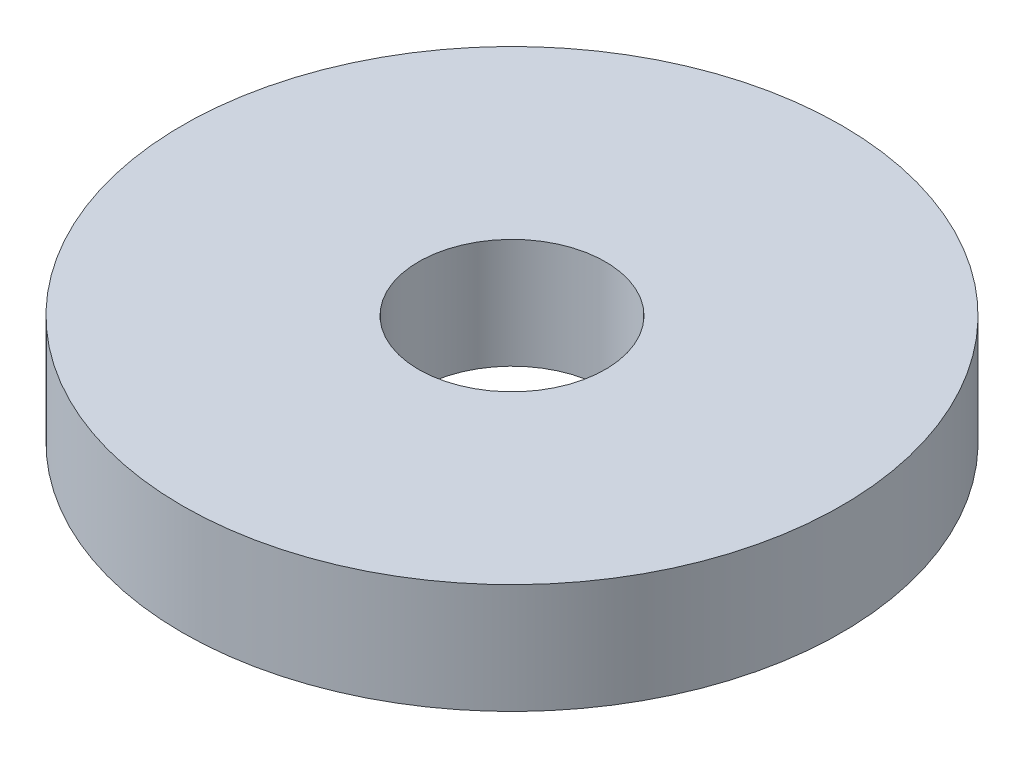
ISO-10303-21;
HEADER;
FILE_DESCRIPTION(('STEP AP214'),'2;1');
FILE_NAME('part.step','',(''),(''),'','','');
FILE_SCHEMA(('AUTOMOTIVE_DESIGN { 1 0 10303 214 1 1 1 1 }'));
ENDSEC;
DATA;
#1=APPLICATION_CONTEXT('core data for automotive mechanical design processes');
#2=APPLICATION_PROTOCOL_DEFINITION('international standard','automotive_design',2000,#1);
#3=PRODUCT_CONTEXT('',#1,'mechanical');
#4=PRODUCT('Part','Part','',(#3));
#5=PRODUCT_RELATED_PRODUCT_CATEGORY('part','',(#4));
#6=PRODUCT_DEFINITION_FORMATION('','',#4);
#7=PRODUCT_DEFINITION_CONTEXT('part definition',#1,'design');
#8=PRODUCT_DEFINITION('design','',#6,#7);
#9=PRODUCT_DEFINITION_SHAPE('','',#8);
#10=(LENGTH_UNIT() NAMED_UNIT(*) SI_UNIT(.MILLI.,.METRE.));
#11=(NAMED_UNIT(*) PLANE_ANGLE_UNIT() SI_UNIT($,.RADIAN.));
#12=(NAMED_UNIT(*) SI_UNIT($,.STERADIAN.) SOLID_ANGLE_UNIT());
#13=UNCERTAINTY_MEASURE_WITH_UNIT(LENGTH_MEASURE(1.E-05),#10,'distance_accuracy_value','');
#14=(GEOMETRIC_REPRESENTATION_CONTEXT(3) GLOBAL_UNCERTAINTY_ASSIGNED_CONTEXT((#13)) GLOBAL_UNIT_ASSIGNED_CONTEXT((#10,
#11,#12)) REPRESENTATION_CONTEXT('',''));
#15=CARTESIAN_POINT('',(0.,0.,0.));
#16=DIRECTION('',(0.,0.,1.));
#17=DIRECTION('',(1.,0.,0.));
#18=AXIS2_PLACEMENT_3D('',#15,#16,#17);
#19=CARTESIAN_POINT('',(0.,-10.,0.));
#20=DIRECTION('',(0.,1.,0.));
#21=DIRECTION('',(0.,0.,0.999999999999997));
#22=AXIS2_PLACEMENT_3D('',#19,#20,#21);
#23=CYLINDRICAL_SURFACE('',#22,30.);
#24=CARTESIAN_POINT('',(0.,-10.,0.));
#25=DIRECTION('',(0.,1.,0.));
#26=DIRECTION('',(0.,0.,0.999999999999997));
#27=AXIS2_PLACEMENT_3D('',#24,#25,#26);
#28=CIRCLE('',#27,30.);
#29=CARTESIAN_POINT('',(0.,-10.,29.9999999999999));
#30=VERTEX_POINT('',#29);
#31=EDGE_CURVE('E10',#30,#30,#28,.T.);
#32=ORIENTED_EDGE('',*,*,#31,.T.);
#33=EDGE_LOOP('',(#32));
#34=FACE_BOUND('',#33,.T.);
#35=CARTESIAN_POINT('',(0.,0.,0.));
#36=DIRECTION('',(0.,1.,0.));
#37=DIRECTION('',(0.,0.,0.999999999999997));
#38=AXIS2_PLACEMENT_3D('',#35,#36,#37);
#39=CIRCLE('',#38,30.);
#40=CARTESIAN_POINT('',(0.,0.,29.9999999999999));
#41=VERTEX_POINT('',#40);
#42=EDGE_CURVE('E39',#41,#41,#39,.T.);
#43=ORIENTED_EDGE('',*,*,#42,.F.);
#44=EDGE_LOOP('',(#43));
#45=FACE_BOUND('',#44,.T.);
#46=ADVANCED_FACE('F36',(#34,#45),#23,.T.);
#47=CARTESIAN_POINT('',(0.,-10.,0.));
#48=DIRECTION('',(0.,1.,0.));
#49=DIRECTION('',(0.,0.,0.999999999999997));
#50=AXIS2_PLACEMENT_3D('',#47,#48,#49);
#51=PLANE('',#50);
#52=CARTESIAN_POINT('',(0.,-10.,0.));
#53=DIRECTION('',(0.,1.,0.));
#54=DIRECTION('',(0.,0.,0.999999999999997));
#55=AXIS2_PLACEMENT_3D('',#52,#53,#54);
#56=CIRCLE('',#55,8.5);
#57=CARTESIAN_POINT('',(0.,-10.,8.49999999999998));
#58=VERTEX_POINT('',#57);
#59=EDGE_CURVE('E46',#58,#58,#56,.T.);
#60=ORIENTED_EDGE('',*,*,#59,.T.);
#61=EDGE_LOOP('',(#60));
#62=FACE_BOUND('',#61,.T.);
#63=ORIENTED_EDGE('',*,*,#31,.F.);
#64=EDGE_LOOP('',(#63));
#65=FACE_BOUND('',#64,.T.);
#66=ADVANCED_FACE('F59',(#62,#65),#51,.F.);
#67=CARTESIAN_POINT('',(0.,0.,0.));
#68=DIRECTION('',(0.,1.,0.));
#69=DIRECTION('',(0.,0.,0.999999999999997));
#70=AXIS2_PLACEMENT_3D('',#67,#68,#69);
#71=PLANE('',#70);
#72=CARTESIAN_POINT('',(0.,0.,0.));
#73=DIRECTION('',(0.,1.,0.));
#74=DIRECTION('',(0.,0.,0.999999999999997));
#75=AXIS2_PLACEMENT_3D('',#72,#73,#74);
#76=CIRCLE('',#75,8.5);
#77=CARTESIAN_POINT('',(0.,0.,8.49999999999998));
#78=VERTEX_POINT('',#77);
#79=EDGE_CURVE('E50',#78,#78,#76,.T.);
#80=ORIENTED_EDGE('',*,*,#79,.F.);
#81=EDGE_LOOP('',(#80));
#82=FACE_BOUND('',#81,.T.);
#83=ORIENTED_EDGE('',*,*,#42,.T.);
#84=EDGE_LOOP('',(#83));
#85=FACE_BOUND('',#84,.T.);
#86=ADVANCED_FACE('F56',(#82,#85),#71,.T.);
#87=CARTESIAN_POINT('',(0.,0.,0.));
#88=DIRECTION('',(0.,1.,0.));
#89=DIRECTION('',(0.,0.,0.999999999999997));
#90=AXIS2_PLACEMENT_3D('',#87,#88,#89);
#91=CYLINDRICAL_SURFACE('',#90,8.5);
#92=ORIENTED_EDGE('',*,*,#59,.F.);
#93=EDGE_LOOP('',(#92));
#94=FACE_BOUND('',#93,.T.);
#95=ORIENTED_EDGE('',*,*,#79,.T.);
#96=EDGE_LOOP('',(#95));
#97=FACE_BOUND('',#96,.T.);
#98=ADVANCED_FACE('F54',(#94,#97),#91,.F.);
#99=CLOSED_SHELL('',(#46,#66,#86,#98));
#100=MANIFOLD_SOLID_BREP('B2',#99);
#101=ADVANCED_BREP_SHAPE_REPRESENTATION('',(#18,#100),#14);
#102=SHAPE_DEFINITION_REPRESENTATION(#9,#101);
ENDSEC;
END-ISO-10303-21;
